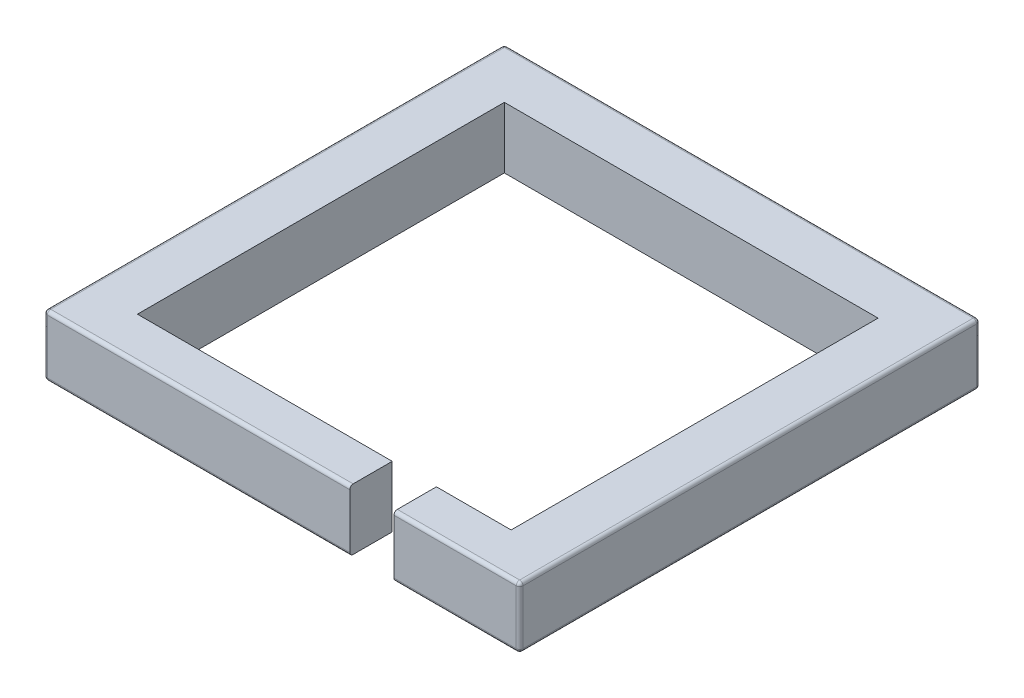
ISO-10303-21;
HEADER;
FILE_DESCRIPTION(('STEP AP214'),'2;1');
FILE_NAME('part.step','',(''),(''),'','','');
FILE_SCHEMA(('AUTOMOTIVE_DESIGN { 1 0 10303 214 1 1 1 1 }'));
ENDSEC;
DATA;
#1=APPLICATION_CONTEXT('core data for automotive mechanical design processes');
#2=APPLICATION_PROTOCOL_DEFINITION('international standard','automotive_design',2000,#1);
#3=PRODUCT_CONTEXT('',#1,'mechanical');
#4=PRODUCT('Part','Part','',(#3));
#5=PRODUCT_RELATED_PRODUCT_CATEGORY('part','',(#4));
#6=PRODUCT_DEFINITION_FORMATION('','',#4);
#7=PRODUCT_DEFINITION_CONTEXT('part definition',#1,'design');
#8=PRODUCT_DEFINITION('design','',#6,#7);
#9=PRODUCT_DEFINITION_SHAPE('','',#8);
#10=(LENGTH_UNIT() NAMED_UNIT(*) SI_UNIT(.MILLI.,.METRE.));
#11=(NAMED_UNIT(*) PLANE_ANGLE_UNIT() SI_UNIT($,.RADIAN.));
#12=(NAMED_UNIT(*) SI_UNIT($,.STERADIAN.) SOLID_ANGLE_UNIT());
#13=UNCERTAINTY_MEASURE_WITH_UNIT(LENGTH_MEASURE(1.E-05),#10,'distance_accuracy_value','');
#14=(GEOMETRIC_REPRESENTATION_CONTEXT(3) GLOBAL_UNCERTAINTY_ASSIGNED_CONTEXT((#13)) GLOBAL_UNIT_ASSIGNED_CONTEXT((#10,
#11,#12)) REPRESENTATION_CONTEXT('',''));
#15=CARTESIAN_POINT('',(0.,0.,0.));
#16=DIRECTION('',(0.,0.,1.));
#17=DIRECTION('',(1.,0.,0.));
#18=AXIS2_PLACEMENT_3D('',#15,#16,#17);
#19=CARTESIAN_POINT('',(-444.5,114.3,422.275));
#20=DIRECTION('',(0.,0.,-1.));
#21=DIRECTION('',(-1.,0.,0.));
#22=AXIS2_PLACEMENT_3D('',#19,#20,#21);
#23=PLANE('',#22);
#24=DIRECTION('',(0.,-1.,0.));
#25=VECTOR('',#24,1.);
#26=CARTESIAN_POINT('',(-438.15,114.3,422.275));
#27=LINE('',#26,#25);
#28=CARTESIAN_POINT('',(-438.15,107.95,422.275));
#29=VERTEX_POINT('',#28);
#30=CARTESIAN_POINT('',(-438.15,6.34999999999999,422.275));
#31=VERTEX_POINT('',#30);
#32=EDGE_CURVE('E274',#29,#31,#27,.T.);
#33=ORIENTED_EDGE('',*,*,#32,.T.);
#34=DIRECTION('',(1.,0.,0.));
#35=VECTOR('',#34,1.);
#36=CARTESIAN_POINT('',(127.,6.34999999999999,422.275));
#37=LINE('',#36,#35);
#38=CARTESIAN_POINT('',(127.,6.34999999999999,422.275));
#39=VERTEX_POINT('',#38);
#40=EDGE_CURVE('E276',#31,#39,#37,.T.);
#41=ORIENTED_EDGE('',*,*,#40,.T.);
#42=DIRECTION('',(0.,1.,0.));
#43=VECTOR('',#42,1.);
#44=CARTESIAN_POINT('',(127.,0.,422.275));
#45=LINE('',#44,#43);
#46=CARTESIAN_POINT('',(127.,107.95,422.275));
#47=VERTEX_POINT('',#46);
#48=EDGE_CURVE('E201',#39,#47,#45,.T.);
#49=ORIENTED_EDGE('',*,*,#48,.T.);
#50=DIRECTION('',(1.,0.,0.));
#51=VECTOR('',#50,1.);
#52=CARTESIAN_POINT('',(-444.5,107.95,422.275));
#53=LINE('',#52,#51);
#54=EDGE_CURVE('E272',#47,#29,#53,.F.);
#55=ORIENTED_EDGE('',*,*,#54,.T.);
#56=EDGE_LOOP('',(#33,#41,#49,#55));
#57=FACE_BOUND('',#56,.T.);
#58=ADVANCED_FACE('F45',(#57),#23,.F.);
#59=CARTESIAN_POINT('',(-349.25,114.3,342.9));
#60=DIRECTION('',(0.,0.,-1.));
#61=DIRECTION('',(-1.,0.,0.));
#62=AXIS2_PLACEMENT_3D('',#59,#60,#61);
#63=PLANE('',#62);
#64=DIRECTION('',(0.,1.,0.));
#65=VECTOR('',#64,1.);
#66=CARTESIAN_POINT('',(127.,0.,342.9));
#67=LINE('',#66,#65);
#68=CARTESIAN_POINT('',(127.,0.,342.9));
#69=VERTEX_POINT('',#68);
#70=CARTESIAN_POINT('',(127.,114.3,342.9));
#71=VERTEX_POINT('',#70);
#72=EDGE_CURVE('E212',#69,#71,#67,.T.);
#73=ORIENTED_EDGE('',*,*,#72,.F.);
#74=DIRECTION('',(1.,0.,0.));
#75=VECTOR('',#74,1.);
#76=CARTESIAN_POINT('',(-349.25,0.,342.9));
#77=LINE('',#76,#75);
#78=CARTESIAN_POINT('',(-349.25,0.,342.9));
#79=VERTEX_POINT('',#78);
#80=EDGE_CURVE('E219',#79,#69,#77,.T.);
#81=ORIENTED_EDGE('',*,*,#80,.F.);
#82=DIRECTION('',(0.,-1.,0.));
#83=VECTOR('',#82,1.);
#84=CARTESIAN_POINT('',(-349.25,114.3,342.9));
#85=LINE('',#84,#83);
#86=CARTESIAN_POINT('',(-349.25,114.3,342.9));
#87=VERTEX_POINT('',#86);
#88=EDGE_CURVE('E230',#87,#79,#85,.T.);
#89=ORIENTED_EDGE('',*,*,#88,.F.);
#90=DIRECTION('',(1.,0.,0.));
#91=VECTOR('',#90,1.);
#92=CARTESIAN_POINT('',(-349.25,114.3,342.9));
#93=LINE('',#92,#91);
#94=EDGE_CURVE('E231',#87,#71,#93,.T.);
#95=ORIENTED_EDGE('',*,*,#94,.T.);
#96=EDGE_LOOP('',(#73,#81,#89,#95));
#97=FACE_BOUND('',#96,.T.);
#98=ADVANCED_FACE('F410',(#97),#63,.T.);
#99=CARTESIAN_POINT('',(0.,114.3,0.));
#100=DIRECTION('',(0.,-1.,0.));
#101=DIRECTION('',(0.,0.,-1.));
#102=AXIS2_PLACEMENT_3D('',#99,#100,#101);
#103=PLANE('',#102);
#104=DIRECTION('',(0.,0.,-1.));
#105=VECTOR('',#104,1.);
#106=CARTESIAN_POINT('',(209.55,114.3,342.9));
#107=LINE('',#106,#105);
#108=CARTESIAN_POINT('',(209.55,114.3,415.925));
#109=VERTEX_POINT('',#108);
#110=CARTESIAN_POINT('',(209.55,114.3,342.9));
#111=VERTEX_POINT('',#110);
#112=EDGE_CURVE('E209',#109,#111,#107,.T.);
#113=ORIENTED_EDGE('',*,*,#112,.F.);
#114=DIRECTION('',(1.,0.,0.));
#115=VECTOR('',#114,1.);
#116=CARTESIAN_POINT('',(0.,114.3,415.925));
#117=LINE('',#116,#115);
#118=CARTESIAN_POINT('',(438.15,114.3,415.925));
#119=VERTEX_POINT('',#118);
#120=EDGE_CURVE('E286',#109,#119,#117,.T.);
#121=ORIENTED_EDGE('',*,*,#120,.T.);
#122=DIRECTION('',(0.,0.,-1.));
#123=VECTOR('',#122,1.);
#124=CARTESIAN_POINT('',(438.15,114.3,0.));
#125=LINE('',#124,#123);
#126=CARTESIAN_POINT('',(438.15,114.3,-431.8));
#127=VERTEX_POINT('',#126);
#128=EDGE_CURVE('E284',#119,#127,#125,.T.);
#129=ORIENTED_EDGE('',*,*,#128,.T.);
#130=DIRECTION('',(-1.,0.,0.));
#131=VECTOR('',#130,1.);
#132=CARTESIAN_POINT('',(0.,114.3,-431.8));
#133=LINE('',#132,#131);
#134=CARTESIAN_POINT('',(-438.15,114.3,-431.8));
#135=VERTEX_POINT('',#134);
#136=EDGE_CURVE('E282',#127,#135,#133,.T.);
#137=ORIENTED_EDGE('',*,*,#136,.T.);
#138=DIRECTION('',(0.,0.,1.));
#139=VECTOR('',#138,1.);
#140=CARTESIAN_POINT('',(-438.15,114.3,0.));
#141=LINE('',#140,#139);
#142=CARTESIAN_POINT('',(-438.15,114.3,415.925));
#143=VERTEX_POINT('',#142);
#144=EDGE_CURVE('E280',#135,#143,#141,.T.);
#145=ORIENTED_EDGE('',*,*,#144,.T.);
#146=DIRECTION('',(1.,0.,0.));
#147=VECTOR('',#146,1.);
#148=CARTESIAN_POINT('',(0.,114.3,415.925));
#149=LINE('',#148,#147);
#150=CARTESIAN_POINT('',(127.,114.3,415.925));
#151=VERTEX_POINT('',#150);
#152=EDGE_CURVE('E278',#143,#151,#149,.T.);
#153=ORIENTED_EDGE('',*,*,#152,.T.);
#154=DIRECTION('',(0.,0.,1.));
#155=VECTOR('',#154,1.);
#156=CARTESIAN_POINT('',(127.,114.3,342.9));
#157=LINE('',#156,#155);
#158=EDGE_CURVE('E368',#71,#151,#157,.T.);
#159=ORIENTED_EDGE('',*,*,#158,.F.);
#160=ORIENTED_EDGE('',*,*,#94,.F.);
#161=DIRECTION('',(0.,0.,1.));
#162=VECTOR('',#161,1.);
#163=CARTESIAN_POINT('',(-349.25,114.3,342.9));
#164=LINE('',#163,#162);
#165=CARTESIAN_POINT('',(-349.25,114.3,-342.9));
#166=VERTEX_POINT('',#165);
#167=EDGE_CURVE('E385',#166,#87,#164,.T.);
#168=ORIENTED_EDGE('',*,*,#167,.F.);
#169=DIRECTION('',(-1.,0.,0.));
#170=VECTOR('',#169,1.);
#171=CARTESIAN_POINT('',(-349.25,114.3,-342.9));
#172=LINE('',#171,#170);
#173=CARTESIAN_POINT('',(349.25,114.3,-342.9));
#174=VERTEX_POINT('',#173);
#175=EDGE_CURVE('E383',#174,#166,#172,.T.);
#176=ORIENTED_EDGE('',*,*,#175,.F.);
#177=DIRECTION('',(0.,0.,-1.));
#178=VECTOR('',#177,1.);
#179=CARTESIAN_POINT('',(349.25,114.3,342.9));
#180=LINE('',#179,#178);
#181=CARTESIAN_POINT('',(349.25,114.3,342.9));
#182=VERTEX_POINT('',#181);
#183=EDGE_CURVE('E223',#182,#174,#180,.T.);
#184=ORIENTED_EDGE('',*,*,#183,.F.);
#185=EDGE_CURVE('E388',#111,#182,#93,.T.);
#186=ORIENTED_EDGE('',*,*,#185,.F.);
#187=EDGE_LOOP('',(#113,#121,#129,#137,#145,#153,#159,#160,#168,#176,#184,#186));
#188=FACE_BOUND('',#187,.T.);
#189=ADVANCED_FACE('F402',(#188),#103,.F.);
#190=CARTESIAN_POINT('',(0.,0.,0.));
#191=DIRECTION('',(0.,-1.,0.));
#192=DIRECTION('',(0.,0.,-1.));
#193=AXIS2_PLACEMENT_3D('',#190,#191,#192);
#194=PLANE('',#193);
#195=DIRECTION('',(0.,0.,-1.));
#196=VECTOR('',#195,1.);
#197=CARTESIAN_POINT('',(438.15,0.,422.275));
#198=LINE('',#197,#196);
#199=CARTESIAN_POINT('',(438.15,0.,-431.8));
#200=VERTEX_POINT('',#199);
#201=CARTESIAN_POINT('',(438.15,0.,415.925));
#202=VERTEX_POINT('',#201);
#203=EDGE_CURVE('E62',#200,#202,#198,.F.);
#204=ORIENTED_EDGE('',*,*,#203,.T.);
#205=DIRECTION('',(1.,0.,0.));
#206=VECTOR('',#205,1.);
#207=CARTESIAN_POINT('',(209.55,0.,415.925));
#208=LINE('',#207,#206);
#209=CARTESIAN_POINT('',(209.55,0.,415.925));
#210=VERTEX_POINT('',#209);
#211=EDGE_CURVE('E198',#202,#210,#208,.F.);
#212=ORIENTED_EDGE('',*,*,#211,.T.);
#213=DIRECTION('',(0.,0.,-1.));
#214=VECTOR('',#213,1.);
#215=CARTESIAN_POINT('',(209.55,0.,342.9));
#216=LINE('',#215,#214);
#217=CARTESIAN_POINT('',(209.55,0.,342.9));
#218=VERTEX_POINT('',#217);
#219=EDGE_CURVE('E191',#210,#218,#216,.T.);
#220=ORIENTED_EDGE('',*,*,#219,.T.);
#221=CARTESIAN_POINT('',(349.25,0.,342.9));
#222=VERTEX_POINT('',#221);
#223=EDGE_CURVE('E196',#218,#222,#77,.T.);
#224=ORIENTED_EDGE('',*,*,#223,.T.);
#225=DIRECTION('',(0.,0.,-1.));
#226=VECTOR('',#225,1.);
#227=CARTESIAN_POINT('',(349.25,0.,342.9));
#228=LINE('',#227,#226);
#229=CARTESIAN_POINT('',(349.25,0.,-342.9));
#230=VERTEX_POINT('',#229);
#231=EDGE_CURVE('E377',#222,#230,#228,.T.);
#232=ORIENTED_EDGE('',*,*,#231,.T.);
#233=DIRECTION('',(-1.,0.,0.));
#234=VECTOR('',#233,1.);
#235=CARTESIAN_POINT('',(-349.25,0.,-342.9));
#236=LINE('',#235,#234);
#237=CARTESIAN_POINT('',(-349.25,0.,-342.9));
#238=VERTEX_POINT('',#237);
#239=EDGE_CURVE('E225',#230,#238,#236,.T.);
#240=ORIENTED_EDGE('',*,*,#239,.T.);
#241=DIRECTION('',(0.,0.,1.));
#242=VECTOR('',#241,1.);
#243=CARTESIAN_POINT('',(-349.25,0.,342.9));
#244=LINE('',#243,#242);
#245=EDGE_CURVE('E220',#238,#79,#244,.T.);
#246=ORIENTED_EDGE('',*,*,#245,.T.);
#247=ORIENTED_EDGE('',*,*,#80,.T.);
#248=DIRECTION('',(0.,0.,1.));
#249=VECTOR('',#248,1.);
#250=CARTESIAN_POINT('',(127.,0.,342.9));
#251=LINE('',#250,#249);
#252=CARTESIAN_POINT('',(127.,0.,415.925));
#253=VERTEX_POINT('',#252);
#254=EDGE_CURVE('E202',#69,#253,#251,.T.);
#255=ORIENTED_EDGE('',*,*,#254,.T.);
#256=DIRECTION('',(1.,0.,0.));
#257=VECTOR('',#256,1.);
#258=CARTESIAN_POINT('',(-444.5,0.,415.925));
#259=LINE('',#258,#257);
#260=CARTESIAN_POINT('',(-438.15,0.,415.925));
#261=VERTEX_POINT('',#260);
#262=EDGE_CURVE('E292',#253,#261,#259,.F.);
#263=ORIENTED_EDGE('',*,*,#262,.T.);
#264=DIRECTION('',(0.,0.,1.));
#265=VECTOR('',#264,1.);
#266=CARTESIAN_POINT('',(-438.15,0.,-438.15));
#267=LINE('',#266,#265);
#268=CARTESIAN_POINT('',(-438.15,0.,-431.8));
#269=VERTEX_POINT('',#268);
#270=EDGE_CURVE('E294',#261,#269,#267,.F.);
#271=ORIENTED_EDGE('',*,*,#270,.T.);
#272=DIRECTION('',(-1.,0.,0.));
#273=VECTOR('',#272,1.);
#274=CARTESIAN_POINT('',(444.5,0.,-431.8));
#275=LINE('',#274,#273);
#276=EDGE_CURVE('E67',#269,#200,#275,.F.);
#277=ORIENTED_EDGE('',*,*,#276,.T.);
#278=EDGE_LOOP('',(#204,#212,#220,#224,#232,#240,#246,#247,#255,#263,#271,#277));
#279=FACE_BOUND('',#278,.T.);
#280=ADVANCED_FACE('F193',(#279),#194,.T.);
#281=CARTESIAN_POINT('',(-444.5,114.3,422.275));
#282=DIRECTION('',(1.,0.,0.));
#283=DIRECTION('',(0.,0.,-1.));
#284=AXIS2_PLACEMENT_3D('',#281,#282,#283);
#285=PLANE('',#284);
#286=DIRECTION('',(0.,-1.,0.));
#287=VECTOR('',#286,1.);
#288=CARTESIAN_POINT('',(-444.5,114.3,415.925));
#289=LINE('',#288,#287);
#290=CARTESIAN_POINT('',(-444.5,6.34999999999999,415.925));
#291=VERTEX_POINT('',#290);
#292=CARTESIAN_POINT('',(-444.5,107.95,415.925));
#293=VERTEX_POINT('',#292);
#294=EDGE_CURVE('E240',#291,#293,#289,.F.);
#295=ORIENTED_EDGE('',*,*,#294,.T.);
#296=DIRECTION('',(0.,0.,1.));
#297=VECTOR('',#296,1.);
#298=CARTESIAN_POINT('',(-444.5,107.95,422.275));
#299=LINE('',#298,#297);
#300=CARTESIAN_POINT('',(-444.5,107.95,-431.8));
#301=VERTEX_POINT('',#300);
#302=EDGE_CURVE('E245',#293,#301,#299,.F.);
#303=ORIENTED_EDGE('',*,*,#302,.T.);
#304=DIRECTION('',(0.,-1.,0.));
#305=VECTOR('',#304,1.);
#306=CARTESIAN_POINT('',(-444.5,114.3,-431.8));
#307=LINE('',#306,#305);
#308=CARTESIAN_POINT('',(-444.5,6.34999999999999,-431.8));
#309=VERTEX_POINT('',#308);
#310=EDGE_CURVE('E242',#301,#309,#307,.T.);
#311=ORIENTED_EDGE('',*,*,#310,.T.);
#312=DIRECTION('',(0.,0.,1.));
#313=VECTOR('',#312,1.);
#314=CARTESIAN_POINT('',(-444.5,6.34999999999999,422.275));
#315=LINE('',#314,#313);
#316=EDGE_CURVE('E238',#309,#291,#315,.T.);
#317=ORIENTED_EDGE('',*,*,#316,.T.);
#318=EDGE_LOOP('',(#295,#303,#311,#317));
#319=FACE_BOUND('',#318,.T.);
#320=ADVANCED_FACE('F514',(#319),#285,.F.);
#321=DIRECTION('',(0.,-1.,0.));
#322=VECTOR('',#321,1.);
#323=CARTESIAN_POINT('',(438.15,114.3,422.275));
#324=LINE('',#323,#322);
#325=CARTESIAN_POINT('',(438.15,6.34999999999999,422.275));
#326=VERTEX_POINT('',#325);
#327=CARTESIAN_POINT('',(438.15,107.95,422.275));
#328=VERTEX_POINT('',#327);
#329=EDGE_CURVE('E267',#326,#328,#324,.F.);
#330=ORIENTED_EDGE('',*,*,#329,.T.);
#331=DIRECTION('',(1.,0.,0.));
#332=VECTOR('',#331,1.);
#333=CARTESIAN_POINT('',(-444.5,107.95,422.275));
#334=LINE('',#333,#332);
#335=CARTESIAN_POINT('',(209.55,107.95,422.275));
#336=VERTEX_POINT('',#335);
#337=EDGE_CURVE('E270',#328,#336,#334,.F.);
#338=ORIENTED_EDGE('',*,*,#337,.T.);
#339=DIRECTION('',(0.,1.,0.));
#340=VECTOR('',#339,1.);
#341=CARTESIAN_POINT('',(209.55,0.,422.275));
#342=LINE('',#341,#340);
#343=CARTESIAN_POINT('',(209.55,6.34999999999999,422.275));
#344=VERTEX_POINT('',#343);
#345=EDGE_CURVE('E213',#344,#336,#342,.T.);
#346=ORIENTED_EDGE('',*,*,#345,.F.);
#347=DIRECTION('',(1.,0.,0.));
#348=VECTOR('',#347,1.);
#349=CARTESIAN_POINT('',(444.5,6.34999999999999,422.275));
#350=LINE('',#349,#348);
#351=EDGE_CURVE('E265',#344,#326,#350,.T.);
#352=ORIENTED_EDGE('',*,*,#351,.T.);
#353=EDGE_LOOP('',(#330,#338,#346,#352));
#354=FACE_BOUND('',#353,.T.);
#355=ADVANCED_FACE('F451',(#354),#23,.F.);
#356=CARTESIAN_POINT('',(444.5,114.3,422.275));
#357=DIRECTION('',(-1.,0.,0.));
#358=DIRECTION('',(0.,0.,1.));
#359=AXIS2_PLACEMENT_3D('',#356,#357,#358);
#360=PLANE('',#359);
#361=DIRECTION('',(0.,-1.,0.));
#362=VECTOR('',#361,1.);
#363=CARTESIAN_POINT('',(444.5,114.3,415.925));
#364=LINE('',#363,#362);
#365=CARTESIAN_POINT('',(444.5,107.95,415.925));
#366=VERTEX_POINT('',#365);
#367=CARTESIAN_POINT('',(444.5,6.34999999999999,415.925));
#368=VERTEX_POINT('',#367);
#369=EDGE_CURVE('E258',#366,#368,#364,.T.);
#370=ORIENTED_EDGE('',*,*,#369,.T.);
#371=DIRECTION('',(0.,0.,-1.));
#372=VECTOR('',#371,1.);
#373=CARTESIAN_POINT('',(444.5,6.34999999999999,-438.15));
#374=LINE('',#373,#372);
#375=CARTESIAN_POINT('',(444.5,6.34999999999999,-431.8));
#376=VERTEX_POINT('',#375);
#377=EDGE_CURVE('E263',#368,#376,#374,.T.);
#378=ORIENTED_EDGE('',*,*,#377,.T.);
#379=DIRECTION('',(0.,-1.,0.));
#380=VECTOR('',#379,1.);
#381=CARTESIAN_POINT('',(444.5,114.3,-431.8));
#382=LINE('',#381,#380);
#383=CARTESIAN_POINT('',(444.5,107.95,-431.8));
#384=VERTEX_POINT('',#383);
#385=EDGE_CURVE('E260',#376,#384,#382,.F.);
#386=ORIENTED_EDGE('',*,*,#385,.T.);
#387=DIRECTION('',(0.,0.,-1.));
#388=VECTOR('',#387,1.);
#389=CARTESIAN_POINT('',(444.5,107.95,422.275));
#390=LINE('',#389,#388);
#391=EDGE_CURVE('E256',#384,#366,#390,.F.);
#392=ORIENTED_EDGE('',*,*,#391,.T.);
#393=EDGE_LOOP('',(#370,#378,#386,#392));
#394=FACE_BOUND('',#393,.T.);
#395=ADVANCED_FACE('F513',(#394),#360,.F.);
#396=CARTESIAN_POINT('',(-444.5,114.3,-438.15));
#397=DIRECTION('',(0.,0.,1.));
#398=DIRECTION('',(1.,0.,0.));
#399=AXIS2_PLACEMENT_3D('',#396,#397,#398);
#400=PLANE('',#399);
#401=DIRECTION('',(0.,-1.,0.));
#402=VECTOR('',#401,1.);
#403=CARTESIAN_POINT('',(438.15,114.3,-438.15));
#404=LINE('',#403,#402);
#405=CARTESIAN_POINT('',(438.15,107.95,-438.15));
#406=VERTEX_POINT('',#405);
#407=CARTESIAN_POINT('',(438.15,6.34999999999999,-438.15));
#408=VERTEX_POINT('',#407);
#409=EDGE_CURVE('E249',#406,#408,#404,.T.);
#410=ORIENTED_EDGE('',*,*,#409,.T.);
#411=DIRECTION('',(-1.,0.,0.));
#412=VECTOR('',#411,1.);
#413=CARTESIAN_POINT('',(-444.5,6.34999999999999,-438.15));
#414=LINE('',#413,#412);
#415=CARTESIAN_POINT('',(-438.15,6.34999999999999,-438.15));
#416=VERTEX_POINT('',#415);
#417=EDGE_CURVE('E254',#408,#416,#414,.T.);
#418=ORIENTED_EDGE('',*,*,#417,.T.);
#419=DIRECTION('',(0.,-1.,0.));
#420=VECTOR('',#419,1.);
#421=CARTESIAN_POINT('',(-438.15,114.3,-438.15));
#422=LINE('',#421,#420);
#423=CARTESIAN_POINT('',(-438.15,107.95,-438.15));
#424=VERTEX_POINT('',#423);
#425=EDGE_CURVE('E251',#416,#424,#422,.F.);
#426=ORIENTED_EDGE('',*,*,#425,.T.);
#427=DIRECTION('',(-1.,0.,0.));
#428=VECTOR('',#427,1.);
#429=CARTESIAN_POINT('',(-444.5,107.95,-438.15));
#430=LINE('',#429,#428);
#431=EDGE_CURVE('E247',#424,#406,#430,.F.);
#432=ORIENTED_EDGE('',*,*,#431,.T.);
#433=EDGE_LOOP('',(#410,#418,#426,#432));
#434=FACE_BOUND('',#433,.T.);
#435=ADVANCED_FACE('F519',(#434),#400,.F.);
#436=CARTESIAN_POINT('',(349.25,114.3,342.9));
#437=DIRECTION('',(-1.,0.,0.));
#438=DIRECTION('',(0.,0.,1.));
#439=AXIS2_PLACEMENT_3D('',#436,#437,#438);
#440=PLANE('',#439);
#441=ORIENTED_EDGE('',*,*,#231,.F.);
#442=DIRECTION('',(0.,-1.,0.));
#443=VECTOR('',#442,1.);
#444=CARTESIAN_POINT('',(349.25,114.3,342.9));
#445=LINE('',#444,#443);
#446=EDGE_CURVE('E218',#182,#222,#445,.T.);
#447=ORIENTED_EDGE('',*,*,#446,.F.);
#448=ORIENTED_EDGE('',*,*,#183,.T.);
#449=DIRECTION('',(0.,-1.,0.));
#450=VECTOR('',#449,1.);
#451=CARTESIAN_POINT('',(349.25,114.3,-342.9));
#452=LINE('',#451,#450);
#453=EDGE_CURVE('E235',#174,#230,#452,.T.);
#454=ORIENTED_EDGE('',*,*,#453,.T.);
#455=EDGE_LOOP('',(#441,#447,#448,#454));
#456=FACE_BOUND('',#455,.T.);
#457=ADVANCED_FACE('F399',(#456),#440,.T.);
#458=CARTESIAN_POINT('',(-349.25,114.3,-342.9));
#459=DIRECTION('',(0.,0.,1.));
#460=DIRECTION('',(1.,0.,0.));
#461=AXIS2_PLACEMENT_3D('',#458,#459,#460);
#462=PLANE('',#461);
#463=ORIENTED_EDGE('',*,*,#239,.F.);
#464=ORIENTED_EDGE('',*,*,#453,.F.);
#465=ORIENTED_EDGE('',*,*,#175,.T.);
#466=DIRECTION('',(0.,-1.,0.));
#467=VECTOR('',#466,1.);
#468=CARTESIAN_POINT('',(-349.25,114.3,-342.9));
#469=LINE('',#468,#467);
#470=EDGE_CURVE('E233',#166,#238,#469,.T.);
#471=ORIENTED_EDGE('',*,*,#470,.T.);
#472=EDGE_LOOP('',(#463,#464,#465,#471));
#473=FACE_BOUND('',#472,.T.);
#474=ADVANCED_FACE('F395',(#473),#462,.T.);
#475=CARTESIAN_POINT('',(-349.25,114.3,342.9));
#476=DIRECTION('',(1.,0.,0.));
#477=DIRECTION('',(0.,0.,-1.));
#478=AXIS2_PLACEMENT_3D('',#475,#476,#477);
#479=PLANE('',#478);
#480=ORIENTED_EDGE('',*,*,#245,.F.);
#481=ORIENTED_EDGE('',*,*,#470,.F.);
#482=ORIENTED_EDGE('',*,*,#167,.T.);
#483=ORIENTED_EDGE('',*,*,#88,.T.);
#484=EDGE_LOOP('',(#480,#481,#482,#483));
#485=FACE_BOUND('',#484,.T.);
#486=ADVANCED_FACE('F406',(#485),#479,.T.);
#487=DIRECTION('',(0.,1.,0.));
#488=VECTOR('',#487,1.);
#489=CARTESIAN_POINT('',(209.55,0.,342.9));
#490=LINE('',#489,#488);
#491=EDGE_CURVE('E205',#218,#111,#490,.T.);
#492=ORIENTED_EDGE('',*,*,#491,.T.);
#493=ORIENTED_EDGE('',*,*,#185,.T.);
#494=ORIENTED_EDGE('',*,*,#446,.T.);
#495=ORIENTED_EDGE('',*,*,#223,.F.);
#496=EDGE_LOOP('',(#492,#493,#494,#495));
#497=FACE_BOUND('',#496,.T.);
#498=ADVANCED_FACE('F216',(#497),#63,.T.);
#499=CARTESIAN_POINT('',(209.55,0.,342.9));
#500=DIRECTION('',(1.,0.,0.));
#501=DIRECTION('',(0.,0.,-1.));
#502=AXIS2_PLACEMENT_3D('',#499,#500,#501);
#503=PLANE('',#502);
#504=ORIENTED_EDGE('',*,*,#345,.T.);
#505=CARTESIAN_POINT('',(209.55,107.95,415.925));
#506=DIRECTION('',(1.,0.,0.));
#507=DIRECTION('',(0.,0.,-1.));
#508=AXIS2_PLACEMENT_3D('',#505,#506,#507);
#509=CIRCLE('',#508,6.35);
#510=EDGE_CURVE('E290',#336,#109,#509,.F.);
#511=ORIENTED_EDGE('',*,*,#510,.T.);
#512=ORIENTED_EDGE('',*,*,#112,.T.);
#513=ORIENTED_EDGE('',*,*,#491,.F.);
#514=ORIENTED_EDGE('',*,*,#219,.F.);
#515=CARTESIAN_POINT('',(209.55,6.34999999999999,415.925));
#516=DIRECTION('',(1.,0.,0.));
#517=DIRECTION('',(0.,0.,-1.));
#518=AXIS2_PLACEMENT_3D('',#515,#516,#517);
#519=CIRCLE('',#518,6.35);
#520=EDGE_CURVE('E288',#210,#344,#519,.F.);
#521=ORIENTED_EDGE('',*,*,#520,.T.);
#522=EDGE_LOOP('',(#504,#511,#512,#513,#514,#521));
#523=FACE_BOUND('',#522,.T.);
#524=ADVANCED_FACE('F207',(#523),#503,.F.);
#525=CARTESIAN_POINT('',(127.,0.,342.9));
#526=DIRECTION('',(-1.,0.,0.));
#527=DIRECTION('',(0.,0.,1.));
#528=AXIS2_PLACEMENT_3D('',#525,#526,#527);
#529=PLANE('',#528);
#530=ORIENTED_EDGE('',*,*,#48,.F.);
#531=CARTESIAN_POINT('',(127.,6.34999999999999,415.925));
#532=DIRECTION('',(-1.,0.,0.));
#533=DIRECTION('',(0.,0.,1.));
#534=AXIS2_PLACEMENT_3D('',#531,#532,#533);
#535=CIRCLE('',#534,6.35);
#536=EDGE_CURVE('E11',#39,#253,#535,.F.);
#537=ORIENTED_EDGE('',*,*,#536,.T.);
#538=ORIENTED_EDGE('',*,*,#254,.F.);
#539=ORIENTED_EDGE('',*,*,#72,.T.);
#540=ORIENTED_EDGE('',*,*,#158,.T.);
#541=CARTESIAN_POINT('',(127.,107.95,415.925));
#542=DIRECTION('',(-1.,0.,0.));
#543=DIRECTION('',(0.,0.,1.));
#544=AXIS2_PLACEMENT_3D('',#541,#542,#543);
#545=CIRCLE('',#544,6.35);
#546=EDGE_CURVE('E54',#151,#47,#545,.F.);
#547=ORIENTED_EDGE('',*,*,#546,.T.);
#548=EDGE_LOOP('',(#530,#537,#538,#539,#540,#547));
#549=FACE_BOUND('',#548,.T.);
#550=ADVANCED_FACE('F494',(#549),#529,.F.);
#551=CARTESIAN_POINT('',(0.,107.95,415.925));
#552=DIRECTION('',(1.,0.,0.));
#553=DIRECTION('',(0.,0.,-1.));
#554=AXIS2_PLACEMENT_3D('',#551,#552,#553);
#555=CYLINDRICAL_SURFACE('',#554,6.35);
#556=ORIENTED_EDGE('',*,*,#510,.F.);
#557=ORIENTED_EDGE('',*,*,#337,.F.);
#558=CARTESIAN_POINT('',(438.15,107.95,415.925));
#559=DIRECTION('',(1.,0.,0.));
#560=DIRECTION('',(0.,0.,-1.));
#561=AXIS2_PLACEMENT_3D('',#558,#559,#560);
#562=CIRCLE('',#561,6.35);
#563=EDGE_CURVE('E362',#119,#328,#562,.T.);
#564=ORIENTED_EDGE('',*,*,#563,.F.);
#565=ORIENTED_EDGE('',*,*,#120,.F.);
#566=EDGE_LOOP('',(#556,#557,#564,#565));
#567=FACE_BOUND('',#566,.T.);
#568=ADVANCED_FACE('F47',(#567),#555,.T.);
#569=CARTESIAN_POINT('',(-444.5,6.34999999999999,415.925));
#570=DIRECTION('',(-1.,0.,0.));
#571=DIRECTION('',(0.,0.,1.));
#572=AXIS2_PLACEMENT_3D('',#569,#570,#571);
#573=CYLINDRICAL_SURFACE('',#572,6.35);
#574=ORIENTED_EDGE('',*,*,#520,.F.);
#575=ORIENTED_EDGE('',*,*,#211,.F.);
#576=CARTESIAN_POINT('',(438.15,6.34999999999999,415.925));
#577=DIRECTION('',(1.,0.,0.));
#578=DIRECTION('',(0.,0.,-1.));
#579=AXIS2_PLACEMENT_3D('',#576,#577,#578);
#580=CIRCLE('',#579,6.35);
#581=EDGE_CURVE('E360',#326,#202,#580,.T.);
#582=ORIENTED_EDGE('',*,*,#581,.F.);
#583=ORIENTED_EDGE('',*,*,#351,.F.);
#584=EDGE_LOOP('',(#574,#575,#582,#583));
#585=FACE_BOUND('',#584,.T.);
#586=ADVANCED_FACE('F447',(#585),#573,.T.);
#587=CARTESIAN_POINT('',(438.15,114.3,415.925));
#588=DIRECTION('',(0.,-1.,0.));
#589=DIRECTION('',(0.,0.,-1.));
#590=AXIS2_PLACEMENT_3D('',#587,#588,#589);
#591=CYLINDRICAL_SURFACE('',#590,6.35);
#592=CARTESIAN_POINT('',(438.15,107.95,415.925));
#593=DIRECTION('',(0.,1.,0.));
#594=DIRECTION('',(0.,0.,1.));
#595=AXIS2_PLACEMENT_3D('',#592,#593,#594);
#596=CIRCLE('',#595,6.35);
#597=EDGE_CURVE('E49',#328,#366,#596,.T.);
#598=ORIENTED_EDGE('',*,*,#597,.F.);
#599=ORIENTED_EDGE('',*,*,#329,.F.);
#600=CARTESIAN_POINT('',(438.15,6.34999999999999,415.925));
#601=DIRECTION('',(0.,-1.,0.));
#602=DIRECTION('',(0.,0.,-1.));
#603=AXIS2_PLACEMENT_3D('',#600,#601,#602);
#604=CIRCLE('',#603,6.35);
#605=EDGE_CURVE('E357',#368,#326,#604,.T.);
#606=ORIENTED_EDGE('',*,*,#605,.F.);
#607=ORIENTED_EDGE('',*,*,#369,.F.);
#608=EDGE_LOOP('',(#598,#599,#606,#607));
#609=FACE_BOUND('',#608,.T.);
#610=ADVANCED_FACE('F572',(#609),#591,.T.);
#611=CARTESIAN_POINT('',(438.15,107.95,415.925));
#612=DIRECTION('',(0.,0.,1.));
#613=DIRECTION('',(1.,0.,0.));
#614=AXIS2_PLACEMENT_3D('',#611,#612,#613);
#615=SPHERICAL_SURFACE('',#614,6.35);
#616=ORIENTED_EDGE('',*,*,#563,.T.);
#617=ORIENTED_EDGE('',*,*,#597,.T.);
#618=CARTESIAN_POINT('',(438.15,107.95,415.925));
#619=DIRECTION('',(0.,0.,1.));
#620=DIRECTION('',(1.,0.,0.));
#621=AXIS2_PLACEMENT_3D('',#618,#619,#620);
#622=CIRCLE('',#621,6.35);
#623=EDGE_CURVE('E354',#119,#366,#622,.F.);
#624=ORIENTED_EDGE('',*,*,#623,.F.);
#625=EDGE_LOOP('',(#616,#617,#624));
#626=FACE_BOUND('',#625,.T.);
#627=ADVANCED_FACE('F569',(#626),#615,.T.);
#628=CARTESIAN_POINT('',(438.15,6.35,415.925));
#629=DIRECTION('',(0.,0.,1.));
#630=DIRECTION('',(0.,-1.,0.));
#631=AXIS2_PLACEMENT_3D('',#628,#629,#630);
#632=SPHERICAL_SURFACE('',#631,6.35);
#633=ORIENTED_EDGE('',*,*,#605,.T.);
#634=ORIENTED_EDGE('',*,*,#581,.T.);
#635=CARTESIAN_POINT('',(438.15,6.35,415.925));
#636=DIRECTION('',(0.,0.,1.));
#637=DIRECTION('',(1.,0.,0.));
#638=AXIS2_PLACEMENT_3D('',#635,#636,#637);
#639=CIRCLE('',#638,6.35);
#640=EDGE_CURVE('E351',#368,#202,#639,.F.);
#641=ORIENTED_EDGE('',*,*,#640,.F.);
#642=EDGE_LOOP('',(#633,#634,#641));
#643=FACE_BOUND('',#642,.T.);
#644=ADVANCED_FACE('F442',(#643),#632,.T.);
#645=CARTESIAN_POINT('',(438.15,107.95,0.));
#646=DIRECTION('',(0.,0.,-1.));
#647=DIRECTION('',(-1.,0.,0.));
#648=AXIS2_PLACEMENT_3D('',#645,#646,#647);
#649=CYLINDRICAL_SURFACE('',#648,6.35);
#650=ORIENTED_EDGE('',*,*,#623,.T.);
#651=ORIENTED_EDGE('',*,*,#391,.F.);
#652=CARTESIAN_POINT('',(438.15,107.95,-431.8));
#653=DIRECTION('',(0.,0.,-1.));
#654=DIRECTION('',(-1.,0.,0.));
#655=AXIS2_PLACEMENT_3D('',#652,#653,#654);
#656=CIRCLE('',#655,6.35);
#657=EDGE_CURVE('E346',#127,#384,#656,.T.);
#658=ORIENTED_EDGE('',*,*,#657,.F.);
#659=ORIENTED_EDGE('',*,*,#128,.F.);
#660=EDGE_LOOP('',(#650,#651,#658,#659));
#661=FACE_BOUND('',#660,.T.);
#662=ADVANCED_FACE('F463',(#661),#649,.T.);
#663=CARTESIAN_POINT('',(0.,107.95,415.925));
#664=DIRECTION('',(1.,0.,0.));
#665=DIRECTION('',(0.,0.,-1.));
#666=AXIS2_PLACEMENT_3D('',#663,#664,#665);
#667=CYLINDRICAL_SURFACE('',#666,6.35);
#668=ORIENTED_EDGE('',*,*,#546,.F.);
#669=ORIENTED_EDGE('',*,*,#152,.F.);
#670=CARTESIAN_POINT('',(-438.15,107.95,415.925));
#671=DIRECTION('',(-1.,0.,0.));
#672=DIRECTION('',(0.,0.,1.));
#673=AXIS2_PLACEMENT_3D('',#670,#671,#672);
#674=CIRCLE('',#673,6.35);
#675=EDGE_CURVE('E343',#29,#143,#674,.T.);
#676=ORIENTED_EDGE('',*,*,#675,.F.);
#677=ORIENTED_EDGE('',*,*,#54,.F.);
#678=EDGE_LOOP('',(#668,#669,#676,#677));
#679=FACE_BOUND('',#678,.T.);
#680=ADVANCED_FACE('F483',(#679),#667,.T.);
#681=CARTESIAN_POINT('',(-438.15,114.3,415.925));
#682=DIRECTION('',(0.,-1.,0.));
#683=DIRECTION('',(0.,0.,-1.));
#684=AXIS2_PLACEMENT_3D('',#681,#682,#683);
#685=CYLINDRICAL_SURFACE('',#684,6.35);
#686=CARTESIAN_POINT('',(-438.15,6.34999999999999,415.925));
#687=DIRECTION('',(0.,-1.,0.));
#688=DIRECTION('',(0.,0.,-1.));
#689=AXIS2_PLACEMENT_3D('',#686,#687,#688);
#690=CIRCLE('',#689,6.35);
#691=EDGE_CURVE('E337',#31,#291,#690,.T.);
#692=ORIENTED_EDGE('',*,*,#691,.F.);
#693=ORIENTED_EDGE('',*,*,#32,.F.);
#694=CARTESIAN_POINT('',(-438.15,107.95,415.925));
#695=DIRECTION('',(0.,1.,0.));
#696=DIRECTION('',(0.,0.,1.));
#697=AXIS2_PLACEMENT_3D('',#694,#695,#696);
#698=CIRCLE('',#697,6.35);
#699=EDGE_CURVE('E340',#293,#29,#698,.T.);
#700=ORIENTED_EDGE('',*,*,#699,.F.);
#701=ORIENTED_EDGE('',*,*,#294,.F.);
#702=EDGE_LOOP('',(#692,#693,#700,#701));
#703=FACE_BOUND('',#702,.T.);
#704=ADVANCED_FACE('F491',(#703),#685,.T.);
#705=CARTESIAN_POINT('',(-444.5,6.34999999999999,415.925));
#706=DIRECTION('',(-1.,0.,0.));
#707=DIRECTION('',(0.,0.,1.));
#708=AXIS2_PLACEMENT_3D('',#705,#706,#707);
#709=CYLINDRICAL_SURFACE('',#708,6.35);
#710=ORIENTED_EDGE('',*,*,#536,.F.);
#711=ORIENTED_EDGE('',*,*,#40,.F.);
#712=CARTESIAN_POINT('',(-438.15,6.35,415.925));
#713=DIRECTION('',(-1.,0.,0.));
#714=DIRECTION('',(0.,0.,1.));
#715=AXIS2_PLACEMENT_3D('',#712,#713,#714);
#716=CIRCLE('',#715,6.35);
#717=EDGE_CURVE('E334',#261,#31,#716,.T.);
#718=ORIENTED_EDGE('',*,*,#717,.F.);
#719=ORIENTED_EDGE('',*,*,#262,.F.);
#720=EDGE_LOOP('',(#710,#711,#718,#719));
#721=FACE_BOUND('',#720,.T.);
#722=ADVANCED_FACE('F416',(#721),#709,.T.);
#723=CARTESIAN_POINT('',(438.15,6.34999999999999,422.275));
#724=DIRECTION('',(0.,0.,1.));
#725=DIRECTION('',(1.,0.,0.));
#726=AXIS2_PLACEMENT_3D('',#723,#724,#725);
#727=CYLINDRICAL_SURFACE('',#726,6.35);
#728=ORIENTED_EDGE('',*,*,#640,.T.);
#729=ORIENTED_EDGE('',*,*,#203,.F.);
#730=CARTESIAN_POINT('',(438.15,6.34999999999999,-431.8));
#731=DIRECTION('',(0.,0.,-1.));
#732=DIRECTION('',(-1.,0.,0.));
#733=AXIS2_PLACEMENT_3D('',#730,#731,#732);
#734=CIRCLE('',#733,6.35);
#735=EDGE_CURVE('E331',#376,#200,#734,.T.);
#736=ORIENTED_EDGE('',*,*,#735,.F.);
#737=ORIENTED_EDGE('',*,*,#377,.F.);
#738=EDGE_LOOP('',(#728,#729,#736,#737));
#739=FACE_BOUND('',#738,.T.);
#740=ADVANCED_FACE('F439',(#739),#727,.T.);
#741=CARTESIAN_POINT('',(438.15,114.3,-431.8));
#742=DIRECTION('',(0.,-1.,0.));
#743=DIRECTION('',(0.,0.,-1.));
#744=AXIS2_PLACEMENT_3D('',#741,#742,#743);
#745=CYLINDRICAL_SURFACE('',#744,6.35);
#746=CARTESIAN_POINT('',(438.15,107.95,-431.8));
#747=DIRECTION('',(0.,1.,0.));
#748=DIRECTION('',(0.,0.,1.));
#749=AXIS2_PLACEMENT_3D('',#746,#747,#748);
#750=CIRCLE('',#749,6.35);
#751=EDGE_CURVE('E348',#384,#406,#750,.T.);
#752=ORIENTED_EDGE('',*,*,#751,.F.);
#753=ORIENTED_EDGE('',*,*,#385,.F.);
#754=CARTESIAN_POINT('',(438.15,6.34999999999999,-431.8));
#755=DIRECTION('',(0.,-1.,0.));
#756=DIRECTION('',(0.,0.,-1.));
#757=AXIS2_PLACEMENT_3D('',#754,#755,#756);
#758=CIRCLE('',#757,6.35);
#759=EDGE_CURVE('E328',#408,#376,#758,.T.);
#760=ORIENTED_EDGE('',*,*,#759,.F.);
#761=ORIENTED_EDGE('',*,*,#409,.F.);
#762=EDGE_LOOP('',(#752,#753,#760,#761));
#763=FACE_BOUND('',#762,.T.);
#764=ADVANCED_FACE('F553',(#763),#745,.T.);
#765=CARTESIAN_POINT('',(438.15,107.95,-431.8));
#766=DIRECTION('',(1.,0.,0.));
#767=DIRECTION('',(0.,0.,-1.));
#768=AXIS2_PLACEMENT_3D('',#765,#766,#767);
#769=SPHERICAL_SURFACE('',#768,6.35);
#770=ORIENTED_EDGE('',*,*,#657,.T.);
#771=ORIENTED_EDGE('',*,*,#751,.T.);
#772=CARTESIAN_POINT('',(438.15,107.95,-431.8));
#773=DIRECTION('',(1.,0.,0.));
#774=DIRECTION('',(0.,1.,0.));
#775=AXIS2_PLACEMENT_3D('',#772,#773,#774);
#776=CIRCLE('',#775,6.35);
#777=EDGE_CURVE('E325',#127,#406,#776,.F.);
#778=ORIENTED_EDGE('',*,*,#777,.F.);
#779=EDGE_LOOP('',(#770,#771,#778));
#780=FACE_BOUND('',#779,.T.);
#781=ADVANCED_FACE('F466',(#780),#769,.T.);
#782=CARTESIAN_POINT('',(-438.15,107.95,415.925));
#783=DIRECTION('',(0.,0.,1.));
#784=DIRECTION('',(1.,0.,0.));
#785=AXIS2_PLACEMENT_3D('',#782,#783,#784);
#786=SPHERICAL_SURFACE('',#785,6.35);
#787=ORIENTED_EDGE('',*,*,#699,.T.);
#788=ORIENTED_EDGE('',*,*,#675,.T.);
#789=CARTESIAN_POINT('',(-438.15,107.95,415.925));
#790=DIRECTION('',(0.,0.,1.));
#791=DIRECTION('',(1.,0.,0.));
#792=AXIS2_PLACEMENT_3D('',#789,#790,#791);
#793=CIRCLE('',#792,6.35);
#794=EDGE_CURVE('E322',#293,#143,#793,.F.);
#795=ORIENTED_EDGE('',*,*,#794,.F.);
#796=EDGE_LOOP('',(#787,#788,#795));
#797=FACE_BOUND('',#796,.T.);
#798=ADVANCED_FACE('F486',(#797),#786,.T.);
#799=CARTESIAN_POINT('',(-438.15,6.35,415.925));
#800=DIRECTION('',(0.,0.,1.));
#801=DIRECTION('',(0.,-1.,0.));
#802=AXIS2_PLACEMENT_3D('',#799,#800,#801);
#803=SPHERICAL_SURFACE('',#802,6.35);
#804=ORIENTED_EDGE('',*,*,#717,.T.);
#805=ORIENTED_EDGE('',*,*,#691,.T.);
#806=CARTESIAN_POINT('',(-438.15,6.34999999999999,415.925));
#807=DIRECTION('',(0.,0.,1.));
#808=DIRECTION('',(1.,0.,0.));
#809=AXIS2_PLACEMENT_3D('',#806,#807,#808);
#810=CIRCLE('',#809,6.35);
#811=EDGE_CURVE('E319',#261,#291,#810,.F.);
#812=ORIENTED_EDGE('',*,*,#811,.F.);
#813=EDGE_LOOP('',(#804,#805,#812));
#814=FACE_BOUND('',#813,.T.);
#815=ADVANCED_FACE('F422',(#814),#803,.T.);
#816=CARTESIAN_POINT('',(438.15,6.35,-431.8));
#817=DIRECTION('',(1.,0.,0.));
#818=DIRECTION('',(0.,1.,0.));
#819=AXIS2_PLACEMENT_3D('',#816,#817,#818);
#820=SPHERICAL_SURFACE('',#819,6.35);
#821=ORIENTED_EDGE('',*,*,#759,.T.);
#822=ORIENTED_EDGE('',*,*,#735,.T.);
#823=CARTESIAN_POINT('',(438.15,6.35,-431.8));
#824=DIRECTION('',(1.,0.,0.));
#825=DIRECTION('',(0.,0.,-1.));
#826=AXIS2_PLACEMENT_3D('',#823,#824,#825);
#827=CIRCLE('',#826,6.35);
#828=EDGE_CURVE('E316',#408,#200,#827,.F.);
#829=ORIENTED_EDGE('',*,*,#828,.F.);
#830=EDGE_LOOP('',(#821,#822,#829));
#831=FACE_BOUND('',#830,.T.);
#832=ADVANCED_FACE('F434',(#831),#820,.T.);
#833=CARTESIAN_POINT('',(0.,107.95,-431.8));
#834=DIRECTION('',(-1.,0.,0.));
#835=DIRECTION('',(0.,0.,1.));
#836=AXIS2_PLACEMENT_3D('',#833,#834,#835);
#837=CYLINDRICAL_SURFACE('',#836,6.35);
#838=ORIENTED_EDGE('',*,*,#777,.T.);
#839=ORIENTED_EDGE('',*,*,#431,.F.);
#840=CARTESIAN_POINT('',(-438.15,107.95,-431.8));
#841=DIRECTION('',(-1.,0.,0.));
#842=DIRECTION('',(0.,0.,1.));
#843=AXIS2_PLACEMENT_3D('',#840,#841,#842);
#844=CIRCLE('',#843,6.35);
#845=EDGE_CURVE('E313',#135,#424,#844,.T.);
#846=ORIENTED_EDGE('',*,*,#845,.F.);
#847=ORIENTED_EDGE('',*,*,#136,.F.);
#848=EDGE_LOOP('',(#838,#839,#846,#847));
#849=FACE_BOUND('',#848,.T.);
#850=ADVANCED_FACE('F470',(#849),#837,.T.);
#851=CARTESIAN_POINT('',(-438.15,107.95,0.));
#852=DIRECTION('',(0.,0.,1.));
#853=DIRECTION('',(1.,0.,0.));
#854=AXIS2_PLACEMENT_3D('',#851,#852,#853);
#855=CYLINDRICAL_SURFACE('',#854,6.35);
#856=ORIENTED_EDGE('',*,*,#794,.T.);
#857=ORIENTED_EDGE('',*,*,#144,.F.);
#858=CARTESIAN_POINT('',(-438.15,107.95,-431.8));
#859=DIRECTION('',(0.,0.,-1.));
#860=DIRECTION('',(0.,1.,0.));
#861=AXIS2_PLACEMENT_3D('',#858,#859,#860);
#862=CIRCLE('',#861,6.35);
#863=EDGE_CURVE('E310',#301,#135,#862,.T.);
#864=ORIENTED_EDGE('',*,*,#863,.F.);
#865=ORIENTED_EDGE('',*,*,#302,.F.);
#866=EDGE_LOOP('',(#856,#857,#864,#865));
#867=FACE_BOUND('',#866,.T.);
#868=ADVANCED_FACE('F478',(#867),#855,.T.);
#869=CARTESIAN_POINT('',(-438.15,6.34999999999999,422.275));
#870=DIRECTION('',(0.,0.,-1.));
#871=DIRECTION('',(-1.,0.,0.));
#872=AXIS2_PLACEMENT_3D('',#869,#870,#871);
#873=CYLINDRICAL_SURFACE('',#872,6.35);
#874=ORIENTED_EDGE('',*,*,#811,.T.);
#875=ORIENTED_EDGE('',*,*,#316,.F.);
#876=CARTESIAN_POINT('',(-438.15,6.35,-431.8));
#877=DIRECTION('',(0.,0.,-1.));
#878=DIRECTION('',(-1.,0.,0.));
#879=AXIS2_PLACEMENT_3D('',#876,#877,#878);
#880=CIRCLE('',#879,6.35);
#881=EDGE_CURVE('E307',#269,#309,#880,.T.);
#882=ORIENTED_EDGE('',*,*,#881,.F.);
#883=ORIENTED_EDGE('',*,*,#270,.F.);
#884=EDGE_LOOP('',(#874,#875,#882,#883));
#885=FACE_BOUND('',#884,.T.);
#886=ADVANCED_FACE('F426',(#885),#873,.T.);
#887=CARTESIAN_POINT('',(-444.5,6.34999999999999,-431.8));
#888=DIRECTION('',(1.,0.,0.));
#889=DIRECTION('',(0.,0.,-1.));
#890=AXIS2_PLACEMENT_3D('',#887,#888,#889);
#891=CYLINDRICAL_SURFACE('',#890,6.35);
#892=ORIENTED_EDGE('',*,*,#828,.T.);
#893=ORIENTED_EDGE('',*,*,#276,.F.);
#894=CARTESIAN_POINT('',(-438.15,6.34999999999999,-431.8));
#895=DIRECTION('',(-1.,0.,0.));
#896=DIRECTION('',(0.,0.,1.));
#897=AXIS2_PLACEMENT_3D('',#894,#895,#896);
#898=CIRCLE('',#897,6.35);
#899=EDGE_CURVE('E304',#416,#269,#898,.T.);
#900=ORIENTED_EDGE('',*,*,#899,.F.);
#901=ORIENTED_EDGE('',*,*,#417,.F.);
#902=EDGE_LOOP('',(#892,#893,#900,#901));
#903=FACE_BOUND('',#902,.T.);
#904=ADVANCED_FACE('F429',(#903),#891,.T.);
#905=CARTESIAN_POINT('',(-438.15,107.95,-431.8));
#906=DIRECTION('',(0.,1.,0.));
#907=DIRECTION('',(0.,0.,1.));
#908=AXIS2_PLACEMENT_3D('',#905,#906,#907);
#909=SPHERICAL_SURFACE('',#908,6.35);
#910=ORIENTED_EDGE('',*,*,#863,.T.);
#911=ORIENTED_EDGE('',*,*,#845,.T.);
#912=CARTESIAN_POINT('',(-438.15,107.95,-431.8));
#913=DIRECTION('',(0.,1.,0.));
#914=DIRECTION('',(0.,0.,1.));
#915=AXIS2_PLACEMENT_3D('',#912,#913,#914);
#916=CIRCLE('',#915,6.35);
#917=EDGE_CURVE('E302',#301,#424,#916,.F.);
#918=ORIENTED_EDGE('',*,*,#917,.F.);
#919=EDGE_LOOP('',(#910,#911,#918));
#920=FACE_BOUND('',#919,.T.);
#921=ADVANCED_FACE('F474',(#920),#909,.T.);
#922=CARTESIAN_POINT('',(-438.15,6.35,-431.8));
#923=DIRECTION('',(0.,-1.,0.));
#924=DIRECTION('',(0.,0.,-1.));
#925=AXIS2_PLACEMENT_3D('',#922,#923,#924);
#926=SPHERICAL_SURFACE('',#925,6.35);
#927=ORIENTED_EDGE('',*,*,#899,.T.);
#928=ORIENTED_EDGE('',*,*,#881,.T.);
#929=CARTESIAN_POINT('',(-438.15,6.34999999999999,-431.8));
#930=DIRECTION('',(0.,-1.,0.));
#931=DIRECTION('',(0.,0.,-1.));
#932=AXIS2_PLACEMENT_3D('',#929,#930,#931);
#933=CIRCLE('',#932,6.35);
#934=EDGE_CURVE('E300',#416,#309,#933,.F.);
#935=ORIENTED_EDGE('',*,*,#934,.F.);
#936=EDGE_LOOP('',(#927,#928,#935));
#937=FACE_BOUND('',#936,.T.);
#938=ADVANCED_FACE('F530',(#937),#926,.T.);
#939=CARTESIAN_POINT('',(-438.15,114.3,-431.8));
#940=DIRECTION('',(0.,-1.,0.));
#941=DIRECTION('',(0.,0.,-1.));
#942=AXIS2_PLACEMENT_3D('',#939,#940,#941);
#943=CYLINDRICAL_SURFACE('',#942,6.35);
#944=ORIENTED_EDGE('',*,*,#917,.T.);
#945=ORIENTED_EDGE('',*,*,#425,.F.);
#946=ORIENTED_EDGE('',*,*,#934,.T.);
#947=ORIENTED_EDGE('',*,*,#310,.F.);
#948=EDGE_LOOP('',(#944,#945,#946,#947));
#949=FACE_BOUND('',#948,.T.);
#950=ADVANCED_FACE('F527',(#949),#943,.T.);
#951=CLOSED_SHELL('',(#58,#98,#189,#280,#320,#355,#395,#435,#457,#474,#486,#498,#524,#550,#568,
#586,#610,#627,#644,#662,#680,#704,#722,#740,#764,#781,#798,#815,#832,#850,#868,#886,#904,#921,
#938,#950));
#952=MANIFOLD_SOLID_BREP('B2',#951);
#953=ADVANCED_BREP_SHAPE_REPRESENTATION('',(#18,#952),#14);
#954=SHAPE_DEFINITION_REPRESENTATION(#9,#953);
ENDSEC;
END-ISO-10303-21;
